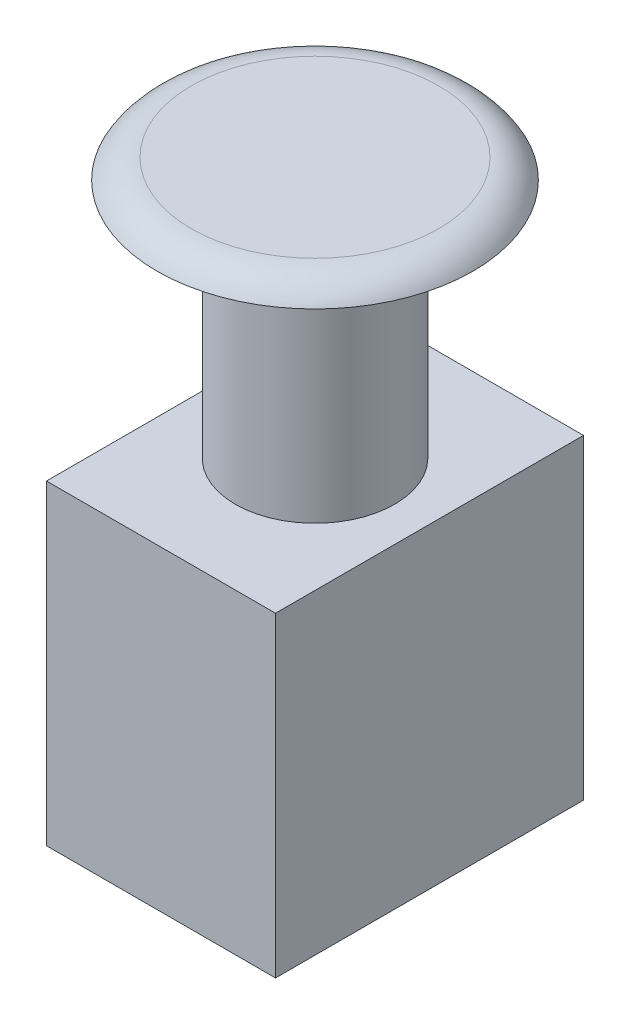
ISO-10303-21;
HEADER;
FILE_DESCRIPTION(('STEP AP214'),'2;1');
FILE_NAME('part.step','',(''),(''),'','','');
FILE_SCHEMA(('AUTOMOTIVE_DESIGN { 1 0 10303 214 1 1 1 1 }'));
ENDSEC;
DATA;
#1=APPLICATION_CONTEXT('core data for automotive mechanical design processes');
#2=APPLICATION_PROTOCOL_DEFINITION('international standard','automotive_design',2000,#1);
#3=PRODUCT_CONTEXT('',#1,'mechanical');
#4=PRODUCT('Part','Part','',(#3));
#5=PRODUCT_RELATED_PRODUCT_CATEGORY('part','',(#4));
#6=PRODUCT_DEFINITION_FORMATION('','',#4);
#7=PRODUCT_DEFINITION_CONTEXT('part definition',#1,'design');
#8=PRODUCT_DEFINITION('design','',#6,#7);
#9=PRODUCT_DEFINITION_SHAPE('','',#8);
#10=(LENGTH_UNIT() NAMED_UNIT(*) SI_UNIT(.MILLI.,.METRE.));
#11=(NAMED_UNIT(*) PLANE_ANGLE_UNIT() SI_UNIT($,.RADIAN.));
#12=(NAMED_UNIT(*) SI_UNIT($,.STERADIAN.) SOLID_ANGLE_UNIT());
#13=UNCERTAINTY_MEASURE_WITH_UNIT(LENGTH_MEASURE(1.E-05),#10,'distance_accuracy_value','');
#14=(GEOMETRIC_REPRESENTATION_CONTEXT(3) GLOBAL_UNCERTAINTY_ASSIGNED_CONTEXT((#13)) GLOBAL_UNIT_ASSIGNED_CONTEXT((#10,
#11,#12)) REPRESENTATION_CONTEXT('',''));
#15=CARTESIAN_POINT('',(0.,0.,0.));
#16=DIRECTION('',(0.,0.,1.));
#17=DIRECTION('',(1.,0.,0.));
#18=AXIS2_PLACEMENT_3D('',#15,#16,#17);
#19=CARTESIAN_POINT('',(0.,73.,0.));
#20=DIRECTION('',(0.,-1.,0.));
#21=DIRECTION('',(0.,0.,-1.));
#22=AXIS2_PLACEMENT_3D('',#19,#20,#21);
#23=CYLINDRICAL_SURFACE('',#22,10.1);
#24=CARTESIAN_POINT('',(0.,40.,0.));
#25=DIRECTION('',(0.,1.,0.));
#26=DIRECTION('',(0.,0.,1.));
#27=AXIS2_PLACEMENT_3D('',#24,#25,#26);
#28=CIRCLE('',#27,10.1);
#29=CARTESIAN_POINT('',(0.,40.,10.1));
#30=VERTEX_POINT('',#29);
#31=EDGE_CURVE('E119',#30,#30,#28,.T.);
#32=ORIENTED_EDGE('',*,*,#31,.T.);
#33=EDGE_LOOP('',(#32));
#34=FACE_BOUND('',#33,.T.);
#35=CARTESIAN_POINT('',(0.,70.5,0.));
#36=DIRECTION('',(0.,1.,0.));
#37=DIRECTION('',(0.,0.,1.));
#38=AXIS2_PLACEMENT_3D('',#35,#36,#37);
#39=CIRCLE('',#38,10.1);
#40=CARTESIAN_POINT('',(0.,70.5,10.1));
#41=VERTEX_POINT('',#40);
#42=EDGE_CURVE('E49',#41,#41,#39,.T.);
#43=ORIENTED_EDGE('',*,*,#42,.F.);
#44=EDGE_LOOP('',(#43));
#45=FACE_BOUND('',#44,.T.);
#46=ADVANCED_FACE('F40',(#34,#45),#23,.T.);
#47=CARTESIAN_POINT('',(-14.5,40.,-19.5));
#48=DIRECTION('',(0.,0.,-1.));
#49=DIRECTION('',(-1.,0.,0.));
#50=AXIS2_PLACEMENT_3D('',#47,#48,#49);
#51=PLANE('',#50);
#52=DIRECTION('',(1.,0.,0.));
#53=VECTOR('',#52,1.);
#54=CARTESIAN_POINT('',(-14.5,0.,-19.5));
#55=LINE('',#54,#53);
#56=CARTESIAN_POINT('',(-14.5,0.,-19.5));
#57=VERTEX_POINT('',#56);
#58=CARTESIAN_POINT('',(14.5,0.,-19.5));
#59=VERTEX_POINT('',#58);
#60=EDGE_CURVE('E110',#57,#59,#55,.T.);
#61=ORIENTED_EDGE('',*,*,#60,.F.);
#62=DIRECTION('',(0.,-1.,0.));
#63=VECTOR('',#62,1.);
#64=CARTESIAN_POINT('',(-14.5,40.,-19.5));
#65=LINE('',#64,#63);
#66=CARTESIAN_POINT('',(-14.5,40.,-19.5));
#67=VERTEX_POINT('',#66);
#68=EDGE_CURVE('E57',#67,#57,#65,.T.);
#69=ORIENTED_EDGE('',*,*,#68,.F.);
#70=DIRECTION('',(1.,0.,0.));
#71=VECTOR('',#70,1.);
#72=CARTESIAN_POINT('',(-14.5,40.,-19.5));
#73=LINE('',#72,#71);
#74=CARTESIAN_POINT('',(14.5,40.,-19.5));
#75=VERTEX_POINT('',#74);
#76=EDGE_CURVE('E104',#67,#75,#73,.T.);
#77=ORIENTED_EDGE('',*,*,#76,.T.);
#78=DIRECTION('',(0.,-1.,0.));
#79=VECTOR('',#78,1.);
#80=CARTESIAN_POINT('',(14.5,40.,-19.5));
#81=LINE('',#80,#79);
#82=EDGE_CURVE('E82',#75,#59,#81,.T.);
#83=ORIENTED_EDGE('',*,*,#82,.T.);
#84=EDGE_LOOP('',(#61,#69,#77,#83));
#85=FACE_BOUND('',#84,.T.);
#86=ADVANCED_FACE('F147',(#85),#51,.T.);
#87=CARTESIAN_POINT('',(-14.5,40.,-19.5));
#88=DIRECTION('',(1.,0.,0.));
#89=DIRECTION('',(0.,0.,-1.));
#90=AXIS2_PLACEMENT_3D('',#87,#88,#89);
#91=PLANE('',#90);
#92=DIRECTION('',(0.,0.,1.));
#93=VECTOR('',#92,1.);
#94=CARTESIAN_POINT('',(-14.5,0.,-19.5));
#95=LINE('',#94,#93);
#96=CARTESIAN_POINT('',(-14.5,0.,19.5));
#97=VERTEX_POINT('',#96);
#98=EDGE_CURVE('E74',#57,#97,#95,.T.);
#99=ORIENTED_EDGE('',*,*,#98,.T.);
#100=DIRECTION('',(0.,-1.,0.));
#101=VECTOR('',#100,1.);
#102=CARTESIAN_POINT('',(-14.5,40.,19.5));
#103=LINE('',#102,#101);
#104=CARTESIAN_POINT('',(-14.5,40.,19.5));
#105=VERTEX_POINT('',#104);
#106=EDGE_CURVE('E101',#105,#97,#103,.T.);
#107=ORIENTED_EDGE('',*,*,#106,.F.);
#108=DIRECTION('',(0.,0.,1.));
#109=VECTOR('',#108,1.);
#110=CARTESIAN_POINT('',(-14.5,40.,-19.5));
#111=LINE('',#110,#109);
#112=EDGE_CURVE('E92',#67,#105,#111,.T.);
#113=ORIENTED_EDGE('',*,*,#112,.F.);
#114=ORIENTED_EDGE('',*,*,#68,.T.);
#115=EDGE_LOOP('',(#99,#107,#113,#114));
#116=FACE_BOUND('',#115,.T.);
#117=ADVANCED_FACE('F152',(#116),#91,.F.);
#118=CARTESIAN_POINT('',(-14.5,40.,19.5));
#119=DIRECTION('',(0.,0.,-1.));
#120=DIRECTION('',(-1.,0.,0.));
#121=AXIS2_PLACEMENT_3D('',#118,#119,#120);
#122=PLANE('',#121);
#123=DIRECTION('',(1.,0.,0.));
#124=VECTOR('',#123,1.);
#125=CARTESIAN_POINT('',(-14.5,0.,19.5));
#126=LINE('',#125,#124);
#127=CARTESIAN_POINT('',(14.5,0.,19.5));
#128=VERTEX_POINT('',#127);
#129=EDGE_CURVE('E99',#97,#128,#126,.T.);
#130=ORIENTED_EDGE('',*,*,#129,.T.);
#131=DIRECTION('',(0.,-1.,0.));
#132=VECTOR('',#131,1.);
#133=CARTESIAN_POINT('',(14.5,40.,19.5));
#134=LINE('',#133,#132);
#135=CARTESIAN_POINT('',(14.5,40.,19.5));
#136=VERTEX_POINT('',#135);
#137=EDGE_CURVE('E96',#136,#128,#134,.T.);
#138=ORIENTED_EDGE('',*,*,#137,.F.);
#139=DIRECTION('',(1.,0.,0.));
#140=VECTOR('',#139,1.);
#141=CARTESIAN_POINT('',(-14.5,40.,19.5));
#142=LINE('',#141,#140);
#143=EDGE_CURVE('E87',#105,#136,#142,.T.);
#144=ORIENTED_EDGE('',*,*,#143,.F.);
#145=ORIENTED_EDGE('',*,*,#106,.T.);
#146=EDGE_LOOP('',(#130,#138,#144,#145));
#147=FACE_BOUND('',#146,.T.);
#148=ADVANCED_FACE('F97',(#147),#122,.F.);
#149=CARTESIAN_POINT('',(14.5,40.,-19.5));
#150=DIRECTION('',(1.,0.,0.));
#151=DIRECTION('',(0.,0.,-1.));
#152=AXIS2_PLACEMENT_3D('',#149,#150,#151);
#153=PLANE('',#152);
#154=DIRECTION('',(0.,0.,1.));
#155=VECTOR('',#154,1.);
#156=CARTESIAN_POINT('',(14.5,0.,-19.5));
#157=LINE('',#156,#155);
#158=EDGE_CURVE('E113',#59,#128,#157,.T.);
#159=ORIENTED_EDGE('',*,*,#158,.F.);
#160=ORIENTED_EDGE('',*,*,#82,.F.);
#161=DIRECTION('',(0.,0.,1.));
#162=VECTOR('',#161,1.);
#163=CARTESIAN_POINT('',(14.5,40.,-19.5));
#164=LINE('',#163,#162);
#165=EDGE_CURVE('E91',#75,#136,#164,.T.);
#166=ORIENTED_EDGE('',*,*,#165,.T.);
#167=ORIENTED_EDGE('',*,*,#137,.T.);
#168=EDGE_LOOP('',(#159,#160,#166,#167));
#169=FACE_BOUND('',#168,.T.);
#170=ADVANCED_FACE('F103',(#169),#153,.T.);
#171=CARTESIAN_POINT('',(0.,40.,0.));
#172=DIRECTION('',(0.,-1.,0.));
#173=DIRECTION('',(0.,0.,-1.));
#174=AXIS2_PLACEMENT_3D('',#171,#172,#173);
#175=PLANE('',#174);
#176=ORIENTED_EDGE('',*,*,#31,.F.);
#177=EDGE_LOOP('',(#176));
#178=FACE_BOUND('',#177,.T.);
#179=ORIENTED_EDGE('',*,*,#76,.F.);
#180=ORIENTED_EDGE('',*,*,#112,.T.);
#181=ORIENTED_EDGE('',*,*,#143,.T.);
#182=ORIENTED_EDGE('',*,*,#165,.F.);
#183=EDGE_LOOP('',(#179,#180,#181,#182));
#184=FACE_BOUND('',#183,.T.);
#185=ADVANCED_FACE('F90',(#178,#184),#175,.F.);
#186=CARTESIAN_POINT('',(0.,0.,0.));
#187=DIRECTION('',(0.,-1.,0.));
#188=DIRECTION('',(0.,0.,-1.));
#189=AXIS2_PLACEMENT_3D('',#186,#187,#188);
#190=PLANE('',#189);
#191=ORIENTED_EDGE('',*,*,#60,.T.);
#192=ORIENTED_EDGE('',*,*,#158,.T.);
#193=ORIENTED_EDGE('',*,*,#129,.F.);
#194=ORIENTED_EDGE('',*,*,#98,.F.);
#195=EDGE_LOOP('',(#191,#192,#193,#194));
#196=FACE_BOUND('',#195,.T.);
#197=ADVANCED_FACE('F136',(#196),#190,.T.);
#198=CARTESIAN_POINT('',(0.,70.5,0.));
#199=DIRECTION('',(0.,1.,0.));
#200=DIRECTION('',(0.,0.,1.));
#201=AXIS2_PLACEMENT_3D('',#198,#199,#200);
#202=PLANE('',#201);
#203=ORIENTED_EDGE('',*,*,#42,.T.);
#204=EDGE_LOOP('',(#203));
#205=FACE_BOUND('',#204,.T.);
#206=CARTESIAN_POINT('',(0.,70.5,0.));
#207=DIRECTION('',(0.,1.,0.));
#208=DIRECTION('',(0.,0.,1.));
#209=AXIS2_PLACEMENT_3D('',#206,#207,#208);
#210=CIRCLE('',#209,20.);
#211=CARTESIAN_POINT('',(0.,70.5,20.));
#212=VERTEX_POINT('',#211);
#213=EDGE_CURVE('E114',#212,#212,#210,.T.);
#214=ORIENTED_EDGE('',*,*,#213,.F.);
#215=EDGE_LOOP('',(#214));
#216=FACE_BOUND('',#215,.T.);
#217=ADVANCED_FACE('F133',(#205,#216),#202,.F.);
#218=CARTESIAN_POINT('',(0.,73.,0.));
#219=DIRECTION('',(0.,1.,0.));
#220=DIRECTION('',(0.,0.,1.));
#221=AXIS2_PLACEMENT_3D('',#218,#219,#220);
#222=PLANE('',#221);
#223=CARTESIAN_POINT('',(0.,73.,0.));
#224=DIRECTION('',(0.,1.,0.));
#225=DIRECTION('',(0.,0.,1.));
#226=AXIS2_PLACEMENT_3D('',#223,#224,#225);
#227=CIRCLE('',#226,15.6698729810778);
#228=CARTESIAN_POINT('',(0.,73.,15.6698729810778));
#229=VERTEX_POINT('',#228);
#230=EDGE_CURVE('E11',#229,#229,#227,.T.);
#231=ORIENTED_EDGE('',*,*,#230,.T.);
#232=EDGE_LOOP('',(#231));
#233=FACE_BOUND('',#232,.T.);
#234=ADVANCED_FACE('F135',(#233),#222,.T.);
#235=CARTESIAN_POINT('',(0.,68.,0.));
#236=DIRECTION('',(0.,-1.,0.));
#237=DIRECTION('',(0.,0.,-1.));
#238=AXIS2_PLACEMENT_3D('',#235,#236,#237);
#239=TOROIDAL_SURFACE('',#238,15.6698729810778,5.);
#240=ORIENTED_EDGE('',*,*,#213,.T.);
#241=EDGE_LOOP('',(#240));
#242=FACE_BOUND('',#241,.T.);
#243=ORIENTED_EDGE('',*,*,#230,.F.);
#244=EDGE_LOOP('',(#243));
#245=FACE_BOUND('',#244,.T.);
#246=ADVANCED_FACE('F42',(#242,#245),#239,.T.);
#247=CLOSED_SHELL('',(#46,#86,#117,#148,#170,#185,#197,#217,#234,#246));
#248=MANIFOLD_SOLID_BREP('B2',#247);
#249=ADVANCED_BREP_SHAPE_REPRESENTATION('',(#18,#248),#14);
#250=SHAPE_DEFINITION_REPRESENTATION(#9,#249);
ENDSEC;
END-ISO-10303-21;
